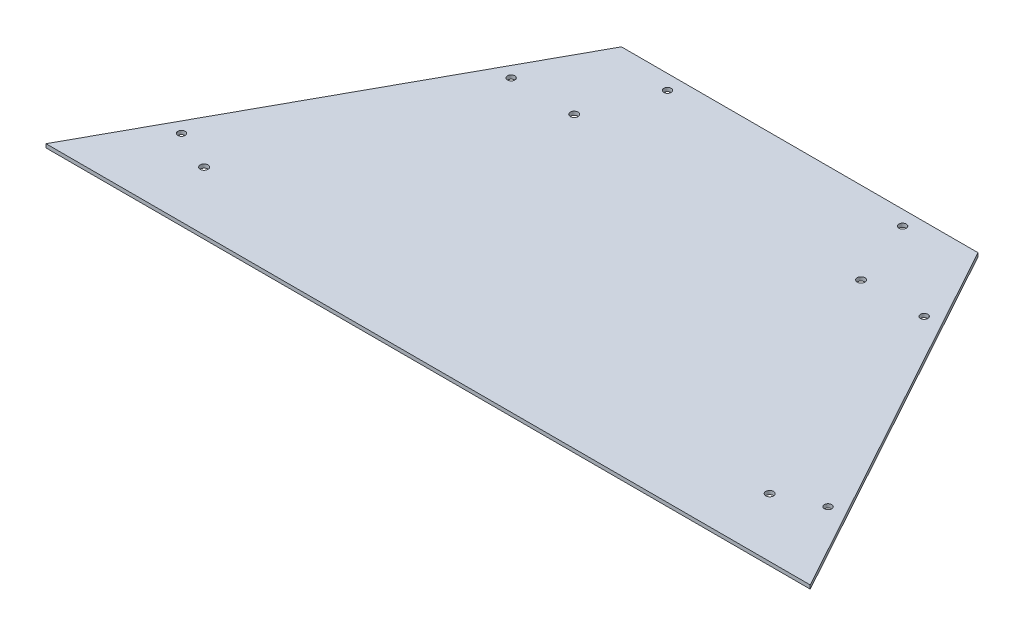
ISO-10303-21;
HEADER;
FILE_DESCRIPTION(('STEP AP214'),'2;1');
FILE_NAME('part.step','',(''),(''),'','','');
FILE_SCHEMA(('AUTOMOTIVE_DESIGN { 1 0 10303 214 1 1 1 1 }'));
ENDSEC;
DATA;
#1=APPLICATION_CONTEXT('core data for automotive mechanical design processes');
#2=APPLICATION_PROTOCOL_DEFINITION('international standard','automotive_design',2000,#1);
#3=PRODUCT_CONTEXT('',#1,'mechanical');
#4=PRODUCT('Part','Part','',(#3));
#5=PRODUCT_RELATED_PRODUCT_CATEGORY('part','',(#4));
#6=PRODUCT_DEFINITION_FORMATION('','',#4);
#7=PRODUCT_DEFINITION_CONTEXT('part definition',#1,'design');
#8=PRODUCT_DEFINITION('design','',#6,#7);
#9=PRODUCT_DEFINITION_SHAPE('','',#8);
#10=(LENGTH_UNIT() NAMED_UNIT(*) SI_UNIT(.MILLI.,.METRE.));
#11=(NAMED_UNIT(*) PLANE_ANGLE_UNIT() SI_UNIT($,.RADIAN.));
#12=(NAMED_UNIT(*) SI_UNIT($,.STERADIAN.) SOLID_ANGLE_UNIT());
#13=UNCERTAINTY_MEASURE_WITH_UNIT(LENGTH_MEASURE(1.E-05),#10,'distance_accuracy_value','');
#14=(GEOMETRIC_REPRESENTATION_CONTEXT(3) GLOBAL_UNCERTAINTY_ASSIGNED_CONTEXT((#13)) GLOBAL_UNIT_ASSIGNED_CONTEXT((#10,
#11,#12)) REPRESENTATION_CONTEXT('',''));
#15=CARTESIAN_POINT('',(0.,0.,0.));
#16=DIRECTION('',(0.,0.,1.));
#17=DIRECTION('',(1.,0.,0.));
#18=AXIS2_PLACEMENT_3D('',#15,#16,#17);
#19=CARTESIAN_POINT('',(0.,0.,0.));
#20=DIRECTION('',(0.,-1.,0.));
#21=DIRECTION('',(0.,0.,-1.));
#22=AXIS2_PLACEMENT_3D('',#19,#20,#21);
#23=PLANE('',#22);
#24=CARTESIAN_POINT('',(-178.463561330701,0.,-250.216315407205));
#25=DIRECTION('',(0.,1.,0.));
#26=DIRECTION('',(0.,0.,1.));
#27=AXIS2_PLACEMENT_3D('',#24,#25,#26);
#28=CIRCLE('',#27,3.1749999999999);
#29=CARTESIAN_POINT('',(-178.463561330701,0.,-247.041315407205));
#30=VERTEX_POINT('',#29);
#31=EDGE_CURVE('E138',#30,#30,#28,.T.);
#32=ORIENTED_EDGE('',*,*,#31,.T.);
#33=EDGE_LOOP('',(#32));
#34=FACE_BOUND('',#33,.T.);
#35=CARTESIAN_POINT('',(-101.6,0.,-308.42891122258));
#36=DIRECTION('',(0.,1.,0.));
#37=DIRECTION('',(0.,0.,1.));
#38=AXIS2_PLACEMENT_3D('',#35,#36,#37);
#39=CIRCLE('',#38,3.17499999999989);
#40=CARTESIAN_POINT('',(-101.6,0.,-305.253911222581));
#41=VERTEX_POINT('',#40);
#42=EDGE_CURVE('E132',#41,#41,#39,.T.);
#43=ORIENTED_EDGE('',*,*,#42,.T.);
#44=EDGE_LOOP('',(#43));
#45=FACE_BOUND('',#44,.T.);
#46=CARTESIAN_POINT('',(279.364444825847,0.,-66.2686866486397));
#47=DIRECTION('',(0.,1.,0.));
#48=DIRECTION('',(0.,0.,1.));
#49=AXIS2_PLACEMENT_3D('',#46,#47,#48);
#50=CIRCLE('',#49,3.17499999999987);
#51=CARTESIAN_POINT('',(279.364444825847,0.,-63.0936866486398));
#52=VERTEX_POINT('',#51);
#53=EDGE_CURVE('E126',#52,#52,#50,.T.);
#54=ORIENTED_EDGE('',*,*,#53,.T.);
#55=EDGE_LOOP('',(#54));
#56=FACE_BOUND('',#55,.T.);
#57=CARTESIAN_POINT('',(178.463561330701,0.,-250.216315407205));
#58=DIRECTION('',(0.,1.,0.));
#59=DIRECTION('',(0.,0.,1.));
#60=AXIS2_PLACEMENT_3D('',#57,#58,#59);
#61=CIRCLE('',#60,3.1749999999999);
#62=CARTESIAN_POINT('',(178.463561330701,0.,-247.041315407205));
#63=VERTEX_POINT('',#62);
#64=EDGE_CURVE('E120',#63,#63,#61,.T.);
#65=ORIENTED_EDGE('',*,*,#64,.T.);
#66=EDGE_LOOP('',(#65));
#67=FACE_BOUND('',#66,.T.);
#68=DIRECTION('',(1.,0.,0.));
#69=VECTOR('',#68,1.);
#70=CARTESIAN_POINT('',(330.2,0.,1.66533453693773E-13));
#71=LINE('',#70,#69);
#72=CARTESIAN_POINT('',(-330.2,0.,0.));
#73=VERTEX_POINT('',#72);
#74=CARTESIAN_POINT('',(330.2,0.,1.66533453693773E-13));
#75=VERTEX_POINT('',#74);
#76=EDGE_CURVE('E101',#73,#75,#71,.T.);
#77=ORIENTED_EDGE('',*,*,#76,.F.);
#78=DIRECTION('',(-0.480929264909847,0.,0.876759398098061));
#79=VECTOR('',#78,1.);
#80=CARTESIAN_POINT('',(-330.2,0.,0.));
#81=LINE('',#80,#79);
#82=CARTESIAN_POINT('',(-154.051,0.,-321.12891122258));
#83=VERTEX_POINT('',#82);
#84=EDGE_CURVE('E77',#83,#73,#81,.T.);
#85=ORIENTED_EDGE('',*,*,#84,.F.);
#86=DIRECTION('',(-1.,0.,0.));
#87=VECTOR('',#86,1.);
#88=CARTESIAN_POINT('',(-154.051,0.,-321.12891122258));
#89=LINE('',#88,#87);
#90=CARTESIAN_POINT('',(154.051,0.,-321.12891122258));
#91=VERTEX_POINT('',#90);
#92=EDGE_CURVE('E71',#91,#83,#89,.T.);
#93=ORIENTED_EDGE('',*,*,#92,.F.);
#94=DIRECTION('',(-0.480929264909847,0.,-0.876759398098061));
#95=VECTOR('',#94,1.);
#96=CARTESIAN_POINT('',(154.051,0.,-321.12891122258));
#97=LINE('',#96,#95);
#98=EDGE_CURVE('E93',#75,#91,#97,.T.);
#99=ORIENTED_EDGE('',*,*,#98,.F.);
#100=EDGE_LOOP('',(#77,#85,#93,#99));
#101=FACE_BOUND('',#100,.T.);
#102=CARTESIAN_POINT('',(101.6,0.,-308.42891122258));
#103=DIRECTION('',(0.,1.,0.));
#104=DIRECTION('',(0.,0.,1.));
#105=AXIS2_PLACEMENT_3D('',#102,#103,#104);
#106=CIRCLE('',#105,3.17499999999989);
#107=CARTESIAN_POINT('',(101.6,0.,-305.253911222581));
#108=VERTEX_POINT('',#107);
#109=EDGE_CURVE('E104',#108,#108,#106,.T.);
#110=ORIENTED_EDGE('',*,*,#109,.T.);
#111=EDGE_LOOP('',(#110));
#112=FACE_BOUND('',#111,.T.);
#113=CARTESIAN_POINT('',(-279.364444825847,0.,-66.2686866486397));
#114=DIRECTION('',(0.,1.,0.));
#115=DIRECTION('',(0.,0.,1.));
#116=AXIS2_PLACEMENT_3D('',#113,#114,#115);
#117=CIRCLE('',#116,3.17499999999987);
#118=CARTESIAN_POINT('',(-279.364444825847,0.,-63.0936866486398));
#119=VERTEX_POINT('',#118);
#120=EDGE_CURVE('E144',#119,#119,#117,.T.);
#121=ORIENTED_EDGE('',*,*,#120,.T.);
#122=EDGE_LOOP('',(#121));
#123=FACE_BOUND('',#122,.T.);
#124=CARTESIAN_POINT('',(123.952,0.,-250.216315407205));
#125=DIRECTION('',(0.,1.,0.));
#126=DIRECTION('',(0.,0.,1.));
#127=AXIS2_PLACEMENT_3D('',#124,#125,#126);
#128=CIRCLE('',#127,3.3781999999999);
#129=CARTESIAN_POINT('',(123.952,0.,-246.838115407205));
#130=VERTEX_POINT('',#129);
#131=EDGE_CURVE('E150',#130,#130,#128,.T.);
#132=ORIENTED_EDGE('',*,*,#131,.T.);
#133=EDGE_LOOP('',(#132));
#134=FACE_BOUND('',#133,.T.);
#135=CARTESIAN_POINT('',(244.348,0.,-50.7999999999999));
#136=DIRECTION('',(0.,1.,0.));
#137=DIRECTION('',(0.,0.,1.));
#138=AXIS2_PLACEMENT_3D('',#135,#136,#137);
#139=CIRCLE('',#138,3.37819999999989);
#140=CARTESIAN_POINT('',(244.348,0.,-47.4218));
#141=VERTEX_POINT('',#140);
#142=EDGE_CURVE('E156',#141,#141,#139,.T.);
#143=ORIENTED_EDGE('',*,*,#142,.T.);
#144=EDGE_LOOP('',(#143));
#145=FACE_BOUND('',#144,.T.);
#146=CARTESIAN_POINT('',(-244.348,0.,-50.7999999999999));
#147=DIRECTION('',(0.,1.,0.));
#148=DIRECTION('',(0.,0.,1.));
#149=AXIS2_PLACEMENT_3D('',#146,#147,#148);
#150=CIRCLE('',#149,3.37819999999989);
#151=CARTESIAN_POINT('',(-244.348,0.,-47.4218));
#152=VERTEX_POINT('',#151);
#153=EDGE_CURVE('E162',#152,#152,#150,.T.);
#154=ORIENTED_EDGE('',*,*,#153,.T.);
#155=EDGE_LOOP('',(#154));
#156=FACE_BOUND('',#155,.T.);
#157=CARTESIAN_POINT('',(-123.952,0.,-250.216315407205));
#158=DIRECTION('',(0.,1.,0.));
#159=DIRECTION('',(0.,0.,1.));
#160=AXIS2_PLACEMENT_3D('',#157,#158,#159);
#161=CIRCLE('',#160,3.37819999999989);
#162=CARTESIAN_POINT('',(-123.952,0.,-246.838115407205));
#163=VERTEX_POINT('',#162);
#164=EDGE_CURVE('E168',#163,#163,#161,.T.);
#165=ORIENTED_EDGE('',*,*,#164,.T.);
#166=EDGE_LOOP('',(#165));
#167=FACE_BOUND('',#166,.T.);
#168=ADVANCED_FACE('F37',(#34,#45,#56,#67,#101,#112,#123,#134,#145,#156,#167),#23,.T.);
#169=CARTESIAN_POINT('',(330.2,3.175,1.66533453693773E-13));
#170=DIRECTION('',(0.,0.,-1.));
#171=DIRECTION('',(-1.,0.,0.));
#172=AXIS2_PLACEMENT_3D('',#169,#170,#171);
#173=PLANE('',#172);
#174=ORIENTED_EDGE('',*,*,#76,.T.);
#175=DIRECTION('',(0.,-1.,0.));
#176=VECTOR('',#175,1.);
#177=CARTESIAN_POINT('',(330.2,3.175,1.66533453693773E-13));
#178=LINE('',#177,#176);
#179=CARTESIAN_POINT('',(330.2,3.175,1.66533453693773E-13));
#180=VERTEX_POINT('',#179);
#181=EDGE_CURVE('E11',#180,#75,#178,.T.);
#182=ORIENTED_EDGE('',*,*,#181,.F.);
#183=DIRECTION('',(1.,0.,0.));
#184=VECTOR('',#183,1.);
#185=CARTESIAN_POINT('',(330.2,3.175,1.66533453693773E-13));
#186=LINE('',#185,#184);
#187=CARTESIAN_POINT('',(-330.2,3.175,0.));
#188=VERTEX_POINT('',#187);
#189=EDGE_CURVE('E89',#188,#180,#186,.T.);
#190=ORIENTED_EDGE('',*,*,#189,.F.);
#191=DIRECTION('',(0.,-1.,0.));
#192=VECTOR('',#191,1.);
#193=CARTESIAN_POINT('',(-330.2,3.175,0.));
#194=LINE('',#193,#192);
#195=EDGE_CURVE('E97',#188,#73,#194,.T.);
#196=ORIENTED_EDGE('',*,*,#195,.T.);
#197=EDGE_LOOP('',(#174,#182,#190,#196));
#198=FACE_BOUND('',#197,.T.);
#199=ADVANCED_FACE('F39',(#198),#173,.F.);
#200=CARTESIAN_POINT('',(154.051,3.175,-321.12891122258));
#201=DIRECTION('',(-0.876759398098061,0.,0.480929264909847));
#202=DIRECTION('',(0.480929264909847,0.,0.876759398098061));
#203=AXIS2_PLACEMENT_3D('',#200,#201,#202);
#204=PLANE('',#203);
#205=ORIENTED_EDGE('',*,*,#98,.T.);
#206=DIRECTION('',(0.,-1.,0.));
#207=VECTOR('',#206,1.);
#208=CARTESIAN_POINT('',(154.051,3.175,-321.12891122258));
#209=LINE('',#208,#207);
#210=CARTESIAN_POINT('',(154.051,3.175,-321.12891122258));
#211=VERTEX_POINT('',#210);
#212=EDGE_CURVE('E46',#211,#91,#209,.T.);
#213=ORIENTED_EDGE('',*,*,#212,.F.);
#214=DIRECTION('',(-0.480929264909847,0.,-0.876759398098061));
#215=VECTOR('',#214,1.);
#216=CARTESIAN_POINT('',(154.051,3.175,-321.12891122258));
#217=LINE('',#216,#215);
#218=EDGE_CURVE('E84',#180,#211,#217,.T.);
#219=ORIENTED_EDGE('',*,*,#218,.F.);
#220=ORIENTED_EDGE('',*,*,#181,.T.);
#221=EDGE_LOOP('',(#205,#213,#219,#220));
#222=FACE_BOUND('',#221,.T.);
#223=ADVANCED_FACE('F92',(#222),#204,.F.);
#224=CARTESIAN_POINT('',(-154.051,3.175,-321.12891122258));
#225=DIRECTION('',(0.,0.,1.));
#226=DIRECTION('',(1.,0.,0.));
#227=AXIS2_PLACEMENT_3D('',#224,#225,#226);
#228=PLANE('',#227);
#229=ORIENTED_EDGE('',*,*,#92,.T.);
#230=DIRECTION('',(0.,-1.,0.));
#231=VECTOR('',#230,1.);
#232=CARTESIAN_POINT('',(-154.051,3.175,-321.12891122258));
#233=LINE('',#232,#231);
#234=CARTESIAN_POINT('',(-154.051,3.175,-321.12891122258));
#235=VERTEX_POINT('',#234);
#236=EDGE_CURVE('E94',#235,#83,#233,.T.);
#237=ORIENTED_EDGE('',*,*,#236,.F.);
#238=DIRECTION('',(-1.,0.,0.));
#239=VECTOR('',#238,1.);
#240=CARTESIAN_POINT('',(-154.051,3.175,-321.12891122258));
#241=LINE('',#240,#239);
#242=EDGE_CURVE('E87',#211,#235,#241,.T.);
#243=ORIENTED_EDGE('',*,*,#242,.F.);
#244=ORIENTED_EDGE('',*,*,#212,.T.);
#245=EDGE_LOOP('',(#229,#237,#243,#244));
#246=FACE_BOUND('',#245,.T.);
#247=ADVANCED_FACE('F95',(#246),#228,.F.);
#248=CARTESIAN_POINT('',(-330.2,3.175,0.));
#249=DIRECTION('',(0.876759398098061,0.,0.480929264909847));
#250=DIRECTION('',(0.480929264909847,0.,-0.876759398098061));
#251=AXIS2_PLACEMENT_3D('',#248,#249,#250);
#252=PLANE('',#251);
#253=ORIENTED_EDGE('',*,*,#84,.T.);
#254=ORIENTED_EDGE('',*,*,#195,.F.);
#255=DIRECTION('',(-0.480929264909847,0.,0.876759398098061));
#256=VECTOR('',#255,1.);
#257=CARTESIAN_POINT('',(-330.2,3.175,0.));
#258=LINE('',#257,#256);
#259=EDGE_CURVE('E54',#235,#188,#258,.T.);
#260=ORIENTED_EDGE('',*,*,#259,.F.);
#261=ORIENTED_EDGE('',*,*,#236,.T.);
#262=EDGE_LOOP('',(#253,#254,#260,#261));
#263=FACE_BOUND('',#262,.T.);
#264=ADVANCED_FACE('F109',(#263),#252,.F.);
#265=CARTESIAN_POINT('',(0.,3.175,0.));
#266=DIRECTION('',(0.,-1.,0.));
#267=DIRECTION('',(0.,0.,-1.));
#268=AXIS2_PLACEMENT_3D('',#265,#266,#267);
#269=PLANE('',#268);
#270=CARTESIAN_POINT('',(-123.952,3.175,-250.216315407205));
#271=DIRECTION('',(0.,1.,0.));
#272=DIRECTION('',(0.,0.,1.));
#273=AXIS2_PLACEMENT_3D('',#270,#271,#272);
#274=CIRCLE('',#273,3.37819999999989);
#275=CARTESIAN_POINT('',(-123.952,3.175,-246.838115407205));
#276=VERTEX_POINT('',#275);
#277=EDGE_CURVE('E171',#276,#276,#274,.T.);
#278=ORIENTED_EDGE('',*,*,#277,.F.);
#279=EDGE_LOOP('',(#278));
#280=FACE_BOUND('',#279,.T.);
#281=CARTESIAN_POINT('',(-244.348,3.175,-50.7999999999999));
#282=DIRECTION('',(0.,1.,0.));
#283=DIRECTION('',(0.,0.,1.));
#284=AXIS2_PLACEMENT_3D('',#281,#282,#283);
#285=CIRCLE('',#284,3.37819999999989);
#286=CARTESIAN_POINT('',(-244.348,3.175,-47.4218));
#287=VERTEX_POINT('',#286);
#288=EDGE_CURVE('E165',#287,#287,#285,.T.);
#289=ORIENTED_EDGE('',*,*,#288,.F.);
#290=EDGE_LOOP('',(#289));
#291=FACE_BOUND('',#290,.T.);
#292=CARTESIAN_POINT('',(244.348,3.175,-50.7999999999999));
#293=DIRECTION('',(0.,1.,0.));
#294=DIRECTION('',(0.,0.,1.));
#295=AXIS2_PLACEMENT_3D('',#292,#293,#294);
#296=CIRCLE('',#295,3.37819999999989);
#297=CARTESIAN_POINT('',(244.348,3.175,-47.4218));
#298=VERTEX_POINT('',#297);
#299=EDGE_CURVE('E159',#298,#298,#296,.T.);
#300=ORIENTED_EDGE('',*,*,#299,.F.);
#301=EDGE_LOOP('',(#300));
#302=FACE_BOUND('',#301,.T.);
#303=CARTESIAN_POINT('',(123.952,3.175,-250.216315407205));
#304=DIRECTION('',(0.,1.,0.));
#305=DIRECTION('',(0.,0.,1.));
#306=AXIS2_PLACEMENT_3D('',#303,#304,#305);
#307=CIRCLE('',#306,3.3781999999999);
#308=CARTESIAN_POINT('',(123.952,3.175,-246.838115407205));
#309=VERTEX_POINT('',#308);
#310=EDGE_CURVE('E153',#309,#309,#307,.T.);
#311=ORIENTED_EDGE('',*,*,#310,.F.);
#312=EDGE_LOOP('',(#311));
#313=FACE_BOUND('',#312,.T.);
#314=CARTESIAN_POINT('',(-279.364444825847,3.175,-66.2686866486397));
#315=DIRECTION('',(0.,1.,0.));
#316=DIRECTION('',(0.,0.,1.));
#317=AXIS2_PLACEMENT_3D('',#314,#315,#316);
#318=CIRCLE('',#317,3.17499999999987);
#319=CARTESIAN_POINT('',(-279.364444825847,3.175,-63.0936866486398));
#320=VERTEX_POINT('',#319);
#321=EDGE_CURVE('E147',#320,#320,#318,.T.);
#322=ORIENTED_EDGE('',*,*,#321,.F.);
#323=EDGE_LOOP('',(#322));
#324=FACE_BOUND('',#323,.T.);
#325=CARTESIAN_POINT('',(-178.463561330701,3.175,-250.216315407205));
#326=DIRECTION('',(0.,1.,0.));
#327=DIRECTION('',(0.,0.,1.));
#328=AXIS2_PLACEMENT_3D('',#325,#326,#327);
#329=CIRCLE('',#328,3.1749999999999);
#330=CARTESIAN_POINT('',(-178.463561330701,3.175,-247.041315407205));
#331=VERTEX_POINT('',#330);
#332=EDGE_CURVE('E141',#331,#331,#329,.T.);
#333=ORIENTED_EDGE('',*,*,#332,.F.);
#334=EDGE_LOOP('',(#333));
#335=FACE_BOUND('',#334,.T.);
#336=CARTESIAN_POINT('',(-101.6,3.175,-308.42891122258));
#337=DIRECTION('',(0.,1.,0.));
#338=DIRECTION('',(0.,0.,1.));
#339=AXIS2_PLACEMENT_3D('',#336,#337,#338);
#340=CIRCLE('',#339,3.17499999999989);
#341=CARTESIAN_POINT('',(-101.6,3.175,-305.253911222581));
#342=VERTEX_POINT('',#341);
#343=EDGE_CURVE('E135',#342,#342,#340,.T.);
#344=ORIENTED_EDGE('',*,*,#343,.F.);
#345=EDGE_LOOP('',(#344));
#346=FACE_BOUND('',#345,.T.);
#347=CARTESIAN_POINT('',(279.364444825847,3.175,-66.2686866486397));
#348=DIRECTION('',(0.,1.,0.));
#349=DIRECTION('',(0.,0.,1.));
#350=AXIS2_PLACEMENT_3D('',#347,#348,#349);
#351=CIRCLE('',#350,3.17499999999987);
#352=CARTESIAN_POINT('',(279.364444825847,3.175,-63.0936866486398));
#353=VERTEX_POINT('',#352);
#354=EDGE_CURVE('E129',#353,#353,#351,.T.);
#355=ORIENTED_EDGE('',*,*,#354,.F.);
#356=EDGE_LOOP('',(#355));
#357=FACE_BOUND('',#356,.T.);
#358=CARTESIAN_POINT('',(178.463561330701,3.175,-250.216315407205));
#359=DIRECTION('',(0.,1.,0.));
#360=DIRECTION('',(0.,0.,1.));
#361=AXIS2_PLACEMENT_3D('',#358,#359,#360);
#362=CIRCLE('',#361,3.1749999999999);
#363=CARTESIAN_POINT('',(178.463561330701,3.175,-247.041315407205));
#364=VERTEX_POINT('',#363);
#365=EDGE_CURVE('E123',#364,#364,#362,.T.);
#366=ORIENTED_EDGE('',*,*,#365,.F.);
#367=EDGE_LOOP('',(#366));
#368=FACE_BOUND('',#367,.T.);
#369=CARTESIAN_POINT('',(101.6,3.175,-308.42891122258));
#370=DIRECTION('',(0.,1.,0.));
#371=DIRECTION('',(0.,0.,1.));
#372=AXIS2_PLACEMENT_3D('',#369,#370,#371);
#373=CIRCLE('',#372,3.17499999999989);
#374=CARTESIAN_POINT('',(101.6,3.175,-305.253911222581));
#375=VERTEX_POINT('',#374);
#376=EDGE_CURVE('E117',#375,#375,#373,.T.);
#377=ORIENTED_EDGE('',*,*,#376,.F.);
#378=EDGE_LOOP('',(#377));
#379=FACE_BOUND('',#378,.T.);
#380=ORIENTED_EDGE('',*,*,#189,.T.);
#381=ORIENTED_EDGE('',*,*,#218,.T.);
#382=ORIENTED_EDGE('',*,*,#242,.T.);
#383=ORIENTED_EDGE('',*,*,#259,.T.);
#384=EDGE_LOOP('',(#380,#381,#382,#383));
#385=FACE_BOUND('',#384,.T.);
#386=ADVANCED_FACE('F85',(#280,#291,#302,#313,#324,#335,#346,#357,#368,#379,#385),#269,.F.);
#387=CARTESIAN_POINT('',(101.6,3.175,-308.42891122258));
#388=DIRECTION('',(0.,1.,0.));
#389=DIRECTION('',(0.,0.,1.));
#390=AXIS2_PLACEMENT_3D('',#387,#388,#389);
#391=CYLINDRICAL_SURFACE('',#390,3.17499999999989);
#392=ORIENTED_EDGE('',*,*,#109,.F.);
#393=EDGE_LOOP('',(#392));
#394=FACE_BOUND('',#393,.T.);
#395=ORIENTED_EDGE('',*,*,#376,.T.);
#396=EDGE_LOOP('',(#395));
#397=FACE_BOUND('',#396,.T.);
#398=ADVANCED_FACE('F179',(#394,#397),#391,.F.);
#399=CARTESIAN_POINT('',(178.463561330701,3.175,-250.216315407205));
#400=DIRECTION('',(0.,1.,0.));
#401=DIRECTION('',(0.,0.,1.));
#402=AXIS2_PLACEMENT_3D('',#399,#400,#401);
#403=CYLINDRICAL_SURFACE('',#402,3.1749999999999);
#404=ORIENTED_EDGE('',*,*,#64,.F.);
#405=EDGE_LOOP('',(#404));
#406=FACE_BOUND('',#405,.T.);
#407=ORIENTED_EDGE('',*,*,#365,.T.);
#408=EDGE_LOOP('',(#407));
#409=FACE_BOUND('',#408,.T.);
#410=ADVANCED_FACE('F200',(#406,#409),#403,.F.);
#411=CARTESIAN_POINT('',(279.364444825847,3.175,-66.2686866486397));
#412=DIRECTION('',(0.,1.,0.));
#413=DIRECTION('',(0.,0.,1.));
#414=AXIS2_PLACEMENT_3D('',#411,#412,#413);
#415=CYLINDRICAL_SURFACE('',#414,3.17499999999987);
#416=ORIENTED_EDGE('',*,*,#53,.F.);
#417=EDGE_LOOP('',(#416));
#418=FACE_BOUND('',#417,.T.);
#419=ORIENTED_EDGE('',*,*,#354,.T.);
#420=EDGE_LOOP('',(#419));
#421=FACE_BOUND('',#420,.T.);
#422=ADVANCED_FACE('F206',(#418,#421),#415,.F.);
#423=CARTESIAN_POINT('',(-101.6,3.175,-308.42891122258));
#424=DIRECTION('',(0.,1.,0.));
#425=DIRECTION('',(0.,0.,1.));
#426=AXIS2_PLACEMENT_3D('',#423,#424,#425);
#427=CYLINDRICAL_SURFACE('',#426,3.17499999999989);
#428=ORIENTED_EDGE('',*,*,#42,.F.);
#429=EDGE_LOOP('',(#428));
#430=FACE_BOUND('',#429,.T.);
#431=ORIENTED_EDGE('',*,*,#343,.T.);
#432=EDGE_LOOP('',(#431));
#433=FACE_BOUND('',#432,.T.);
#434=ADVANCED_FACE('F294',(#430,#433),#427,.F.);
#435=CARTESIAN_POINT('',(-178.463561330701,3.175,-250.216315407205));
#436=DIRECTION('',(0.,1.,0.));
#437=DIRECTION('',(0.,0.,1.));
#438=AXIS2_PLACEMENT_3D('',#435,#436,#437);
#439=CYLINDRICAL_SURFACE('',#438,3.1749999999999);
#440=ORIENTED_EDGE('',*,*,#31,.F.);
#441=EDGE_LOOP('',(#440));
#442=FACE_BOUND('',#441,.T.);
#443=ORIENTED_EDGE('',*,*,#332,.T.);
#444=EDGE_LOOP('',(#443));
#445=FACE_BOUND('',#444,.T.);
#446=ADVANCED_FACE('F290',(#442,#445),#439,.F.);
#447=CARTESIAN_POINT('',(-279.364444825847,3.175,-66.2686866486397));
#448=DIRECTION('',(0.,1.,0.));
#449=DIRECTION('',(0.,0.,1.));
#450=AXIS2_PLACEMENT_3D('',#447,#448,#449);
#451=CYLINDRICAL_SURFACE('',#450,3.17499999999987);
#452=ORIENTED_EDGE('',*,*,#120,.F.);
#453=EDGE_LOOP('',(#452));
#454=FACE_BOUND('',#453,.T.);
#455=ORIENTED_EDGE('',*,*,#321,.T.);
#456=EDGE_LOOP('',(#455));
#457=FACE_BOUND('',#456,.T.);
#458=ADVANCED_FACE('F253',(#454,#457),#451,.F.);
#459=CARTESIAN_POINT('',(123.952,3.175,-250.216315407205));
#460=DIRECTION('',(0.,1.,0.));
#461=DIRECTION('',(0.,0.,1.));
#462=AXIS2_PLACEMENT_3D('',#459,#460,#461);
#463=CYLINDRICAL_SURFACE('',#462,3.3781999999999);
#464=ORIENTED_EDGE('',*,*,#131,.F.);
#465=EDGE_LOOP('',(#464));
#466=FACE_BOUND('',#465,.T.);
#467=ORIENTED_EDGE('',*,*,#310,.T.);
#468=EDGE_LOOP('',(#467));
#469=FACE_BOUND('',#468,.T.);
#470=ADVANCED_FACE('F247',(#466,#469),#463,.F.);
#471=CARTESIAN_POINT('',(244.348,3.175,-50.7999999999999));
#472=DIRECTION('',(0.,1.,0.));
#473=DIRECTION('',(0.,0.,1.));
#474=AXIS2_PLACEMENT_3D('',#471,#472,#473);
#475=CYLINDRICAL_SURFACE('',#474,3.37819999999989);
#476=ORIENTED_EDGE('',*,*,#142,.F.);
#477=EDGE_LOOP('',(#476));
#478=FACE_BOUND('',#477,.T.);
#479=ORIENTED_EDGE('',*,*,#299,.T.);
#480=EDGE_LOOP('',(#479));
#481=FACE_BOUND('',#480,.T.);
#482=ADVANCED_FACE('F252',(#478,#481),#475,.F.);
#483=CARTESIAN_POINT('',(-244.348,3.175,-50.7999999999999));
#484=DIRECTION('',(0.,1.,0.));
#485=DIRECTION('',(0.,0.,1.));
#486=AXIS2_PLACEMENT_3D('',#483,#484,#485);
#487=CYLINDRICAL_SURFACE('',#486,3.37819999999989);
#488=ORIENTED_EDGE('',*,*,#153,.F.);
#489=EDGE_LOOP('',(#488));
#490=FACE_BOUND('',#489,.T.);
#491=ORIENTED_EDGE('',*,*,#288,.T.);
#492=EDGE_LOOP('',(#491));
#493=FACE_BOUND('',#492,.T.);
#494=ADVANCED_FACE('F264',(#490,#493),#487,.F.);
#495=CARTESIAN_POINT('',(-123.952,3.175,-250.216315407205));
#496=DIRECTION('',(0.,1.,0.));
#497=DIRECTION('',(0.,0.,1.));
#498=AXIS2_PLACEMENT_3D('',#495,#496,#497);
#499=CYLINDRICAL_SURFACE('',#498,3.37819999999989);
#500=ORIENTED_EDGE('',*,*,#164,.F.);
#501=EDGE_LOOP('',(#500));
#502=FACE_BOUND('',#501,.T.);
#503=ORIENTED_EDGE('',*,*,#277,.T.);
#504=EDGE_LOOP('',(#503));
#505=FACE_BOUND('',#504,.T.);
#506=ADVANCED_FACE('F175',(#502,#505),#499,.F.);
#507=CLOSED_SHELL('',(#168,#199,#223,#247,#264,#386,#398,#410,#422,#434,#446,#458,#470,#482,
#494,#506));
#508=MANIFOLD_SOLID_BREP('B2',#507);
#509=ADVANCED_BREP_SHAPE_REPRESENTATION('',(#18,#508),#14);
#510=SHAPE_DEFINITION_REPRESENTATION(#9,#509);
ENDSEC;
END-ISO-10303-21;
